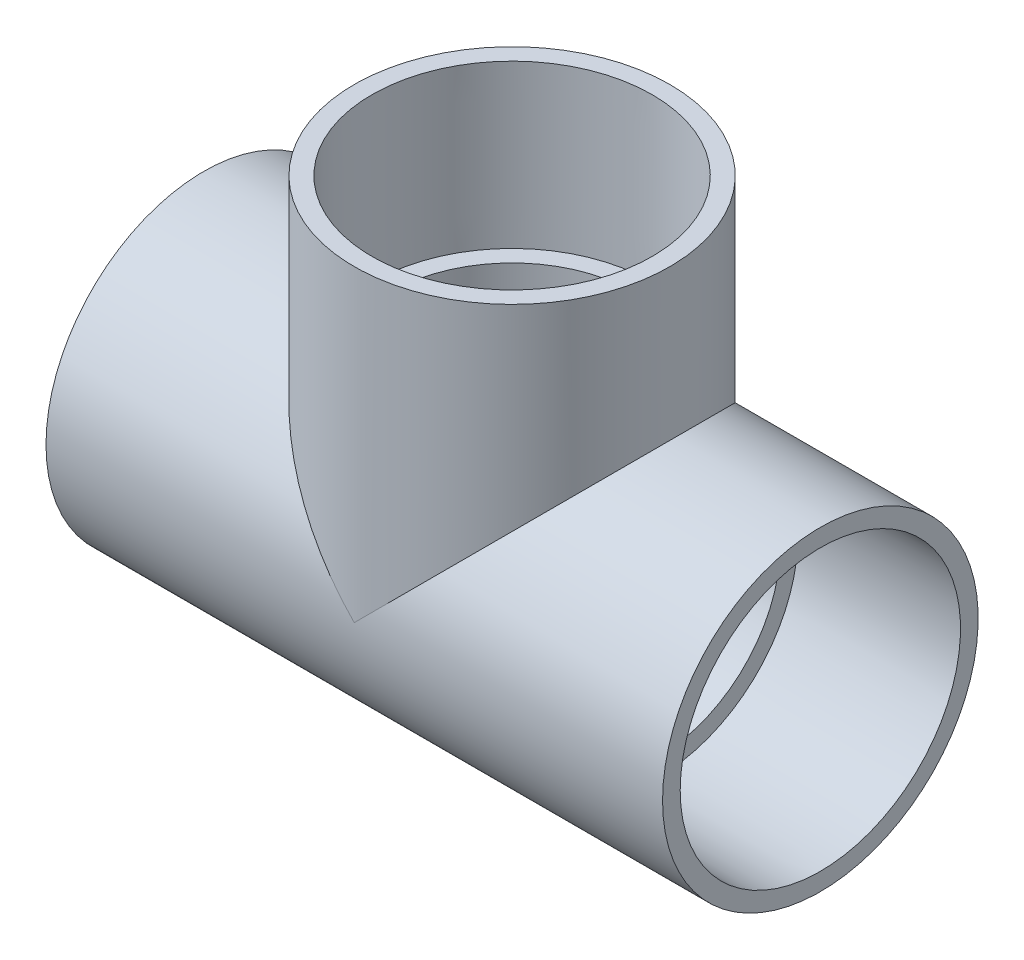
ISO-10303-21;
HEADER;
FILE_DESCRIPTION(('STEP AP214'),'2;1');
FILE_NAME('part.step','',(''),(''),'','','');
FILE_SCHEMA(('AUTOMOTIVE_DESIGN { 1 0 10303 214 1 1 1 1 }'));
ENDSEC;
DATA;
#1=APPLICATION_CONTEXT('core data for automotive mechanical design processes');
#2=APPLICATION_PROTOCOL_DEFINITION('international standard','automotive_design',2000,#1);
#3=PRODUCT_CONTEXT('',#1,'mechanical');
#4=PRODUCT('Part','Part','',(#3));
#5=PRODUCT_RELATED_PRODUCT_CATEGORY('part','',(#4));
#6=PRODUCT_DEFINITION_FORMATION('','',#4);
#7=PRODUCT_DEFINITION_CONTEXT('part definition',#1,'design');
#8=PRODUCT_DEFINITION('design','',#6,#7);
#9=PRODUCT_DEFINITION_SHAPE('','',#8);
#10=(LENGTH_UNIT() NAMED_UNIT(*) SI_UNIT(.MILLI.,.METRE.));
#11=(NAMED_UNIT(*) PLANE_ANGLE_UNIT() SI_UNIT($,.RADIAN.));
#12=(NAMED_UNIT(*) SI_UNIT($,.STERADIAN.) SOLID_ANGLE_UNIT());
#13=UNCERTAINTY_MEASURE_WITH_UNIT(LENGTH_MEASURE(1.E-05),#10,'distance_accuracy_value','');
#14=(GEOMETRIC_REPRESENTATION_CONTEXT(3) GLOBAL_UNCERTAINTY_ASSIGNED_CONTEXT((#13)) GLOBAL_UNIT_ASSIGNED_CONTEXT((#10,
#11,#12)) REPRESENTATION_CONTEXT('',''));
#15=CARTESIAN_POINT('',(0.,0.,0.));
#16=DIRECTION('',(0.,0.,1.));
#17=DIRECTION('',(1.,0.,0.));
#18=AXIS2_PLACEMENT_3D('',#15,#16,#17);
#19=CARTESIAN_POINT('',(-66.675,0.,0.));
#20=DIRECTION('',(-1.,0.,0.));
#21=DIRECTION('',(0.,0.,1.));
#22=AXIS2_PLACEMENT_3D('',#19,#20,#21);
#23=CYLINDRICAL_SURFACE('',#22,34.13125);
#24=CARTESIAN_POINT('',(-66.675,0.,0.));
#25=DIRECTION('',(-1.,0.,0.));
#26=DIRECTION('',(0.,0.,1.));
#27=AXIS2_PLACEMENT_3D('',#24,#25,#26);
#28=CIRCLE('',#27,34.13125);
#29=CARTESIAN_POINT('',(-66.675,0.,34.13125));
#30=VERTEX_POINT('',#29);
#31=EDGE_CURVE('E100',#30,#30,#28,.T.);
#32=ORIENTED_EDGE('',*,*,#31,.F.);
#33=EDGE_LOOP('',(#32));
#34=FACE_BOUND('',#33,.T.);
#35=CARTESIAN_POINT('',(66.675,0.,0.));
#36=DIRECTION('',(-1.,0.,0.));
#37=DIRECTION('',(0.,0.,1.));
#38=AXIS2_PLACEMENT_3D('',#35,#36,#37);
#39=CIRCLE('',#38,34.13125);
#40=CARTESIAN_POINT('',(66.675,0.,34.13125));
#41=VERTEX_POINT('',#40);
#42=EDGE_CURVE('E78',#41,#41,#39,.T.);
#43=ORIENTED_EDGE('',*,*,#42,.T.);
#44=EDGE_LOOP('',(#43));
#45=FACE_BOUND('',#44,.T.);
#46=CARTESIAN_POINT('',(0.,0.,0.));
#47=DIRECTION('',(-0.707106781186547,-0.707106781186547,0.));
#48=DIRECTION('',(-0.707106781186547,0.707106781186547,0.));
#49=AXIS2_PLACEMENT_3D('',#46,#47,#48);
#50=ELLIPSE('',#49,48.2688766507467,34.13125);
#51=CARTESIAN_POINT('',(0.,0.,-34.13125));
#52=VERTEX_POINT('',#51);
#53=CARTESIAN_POINT('',(0.,0.,34.13125));
#54=VERTEX_POINT('',#53);
#55=EDGE_CURVE('E55',#52,#54,#50,.F.);
#56=ORIENTED_EDGE('',*,*,#55,.F.);
#57=CARTESIAN_POINT('',(0.,0.,0.));
#58=DIRECTION('',(0.707106781186547,-0.707106781186547,0.));
#59=DIRECTION('',(-0.707106781186547,-0.707106781186547,0.));
#60=AXIS2_PLACEMENT_3D('',#57,#58,#59);
#61=ELLIPSE('',#60,48.2688766507467,34.13125);
#62=EDGE_CURVE('E91',#52,#54,#61,.T.);
#63=ORIENTED_EDGE('',*,*,#62,.T.);
#64=EDGE_LOOP('',(#56,#63));
#65=FACE_BOUND('',#64,.T.);
#66=ADVANCED_FACE('F36',(#34,#45,#65),#23,.T.);
#67=CARTESIAN_POINT('',(-66.675,-34.13125,0.));
#68=DIRECTION('',(-1.,0.,0.));
#69=DIRECTION('',(0.,0.,1.));
#70=AXIS2_PLACEMENT_3D('',#67,#68,#69);
#71=PLANE('',#70);
#72=ORIENTED_EDGE('',*,*,#31,.T.);
#73=EDGE_LOOP('',(#72));
#74=FACE_BOUND('',#73,.T.);
#75=CARTESIAN_POINT('',(-66.675,0.,0.));
#76=DIRECTION('',(-1.,0.,0.));
#77=DIRECTION('',(0.,0.,1.));
#78=AXIS2_PLACEMENT_3D('',#75,#76,#77);
#79=CIRCLE('',#78,30.3149);
#80=CARTESIAN_POINT('',(-66.675,0.,30.3149));
#81=VERTEX_POINT('',#80);
#82=EDGE_CURVE('E108',#81,#81,#79,.T.);
#83=ORIENTED_EDGE('',*,*,#82,.F.);
#84=EDGE_LOOP('',(#83));
#85=FACE_BOUND('',#84,.T.);
#86=ADVANCED_FACE('F38',(#74,#85),#71,.T.);
#87=CARTESIAN_POINT('',(-31.75,0.,0.));
#88=DIRECTION('',(-1.,0.,0.));
#89=DIRECTION('',(0.,0.,1.));
#90=AXIS2_PLACEMENT_3D('',#87,#88,#89);
#91=CONICAL_SURFACE('',#90,30.0863,0.00654536107227494);
#92=ORIENTED_EDGE('',*,*,#82,.T.);
#93=EDGE_LOOP('',(#92));
#94=FACE_BOUND('',#93,.T.);
#95=CARTESIAN_POINT('',(-31.75,0.,0.));
#96=DIRECTION('',(-1.,0.,0.));
#97=DIRECTION('',(0.,0.,1.));
#98=AXIS2_PLACEMENT_3D('',#95,#96,#97);
#99=CIRCLE('',#98,30.0863);
#100=CARTESIAN_POINT('',(-31.75,0.,30.0863));
#101=VERTEX_POINT('',#100);
#102=EDGE_CURVE('E105',#101,#101,#99,.T.);
#103=ORIENTED_EDGE('',*,*,#102,.F.);
#104=EDGE_LOOP('',(#103));
#105=FACE_BOUND('',#104,.T.);
#106=ADVANCED_FACE('F142',(#94,#105),#91,.F.);
#107=CARTESIAN_POINT('',(126.618899054498,31.75,-12.5251637339597));
#108=DIRECTION('',(0.,-1.,0.));
#109=DIRECTION('',(0.,0.,-1.));
#110=AXIS2_PLACEMENT_3D('',#107,#108,#109);
#111=PLANE('',#110);
#112=CARTESIAN_POINT('',(0.,31.75,0.));
#113=DIRECTION('',(0.,1.,0.));
#114=DIRECTION('',(0.,0.,1.));
#115=AXIS2_PLACEMENT_3D('',#112,#113,#114);
#116=CIRCLE('',#115,26.2509);
#117=CARTESIAN_POINT('',(0.,31.75,26.2509));
#118=VERTEX_POINT('',#117);
#119=EDGE_CURVE('E76',#118,#118,#116,.T.);
#120=ORIENTED_EDGE('',*,*,#119,.F.);
#121=EDGE_LOOP('',(#120));
#122=FACE_BOUND('',#121,.T.);
#123=CARTESIAN_POINT('',(0.,31.75,0.));
#124=DIRECTION('',(0.,-1.,0.));
#125=DIRECTION('',(0.,0.,-1.));
#126=AXIS2_PLACEMENT_3D('',#123,#124,#125);
#127=CIRCLE('',#126,30.0863);
#128=CARTESIAN_POINT('',(0.,31.75,-30.0863));
#129=VERTEX_POINT('',#128);
#130=EDGE_CURVE('E62',#129,#129,#127,.F.);
#131=ORIENTED_EDGE('',*,*,#130,.T.);
#132=EDGE_LOOP('',(#131));
#133=FACE_BOUND('',#132,.T.);
#134=ADVANCED_FACE('F114',(#122,#133),#111,.F.);
#135=CARTESIAN_POINT('',(-31.75,0.,0.));
#136=DIRECTION('',(1.,0.,0.));
#137=DIRECTION('',(0.,0.,-1.));
#138=AXIS2_PLACEMENT_3D('',#135,#136,#137);
#139=PLANE('',#138);
#140=CARTESIAN_POINT('',(-31.75,0.,0.));
#141=DIRECTION('',(-1.,0.,0.));
#142=DIRECTION('',(0.,0.,1.));
#143=AXIS2_PLACEMENT_3D('',#140,#141,#142);
#144=CIRCLE('',#143,26.2509);
#145=CARTESIAN_POINT('',(-31.75,0.,26.2509));
#146=VERTEX_POINT('',#145);
#147=EDGE_CURVE('E74',#146,#146,#144,.T.);
#148=ORIENTED_EDGE('',*,*,#147,.F.);
#149=EDGE_LOOP('',(#148));
#150=FACE_BOUND('',#149,.T.);
#151=ORIENTED_EDGE('',*,*,#102,.T.);
#152=EDGE_LOOP('',(#151));
#153=FACE_BOUND('',#152,.T.);
#154=ADVANCED_FACE('F127',(#150,#153),#139,.F.);
#155=CARTESIAN_POINT('',(34.13125,66.675,0.));
#156=DIRECTION('',(0.,1.,0.));
#157=DIRECTION('',(0.,0.,1.));
#158=AXIS2_PLACEMENT_3D('',#155,#156,#157);
#159=PLANE('',#158);
#160=CARTESIAN_POINT('',(0.,66.675,0.));
#161=DIRECTION('',(0.,-1.,0.));
#162=DIRECTION('',(0.,0.,-1.));
#163=AXIS2_PLACEMENT_3D('',#160,#161,#162);
#164=CIRCLE('',#163,30.3149);
#165=CARTESIAN_POINT('',(0.,66.675,-30.3149));
#166=VERTEX_POINT('',#165);
#167=EDGE_CURVE('E93',#166,#166,#164,.T.);
#168=ORIENTED_EDGE('',*,*,#167,.T.);
#169=EDGE_LOOP('',(#168));
#170=FACE_BOUND('',#169,.T.);
#171=CARTESIAN_POINT('',(0.,66.675,0.));
#172=DIRECTION('',(0.,-1.,0.));
#173=DIRECTION('',(0.,0.,-1.));
#174=AXIS2_PLACEMENT_3D('',#171,#172,#173);
#175=CIRCLE('',#174,34.13125);
#176=CARTESIAN_POINT('',(0.,66.675,-34.13125));
#177=VERTEX_POINT('',#176);
#178=EDGE_CURVE('E96',#177,#177,#175,.T.);
#179=ORIENTED_EDGE('',*,*,#178,.F.);
#180=EDGE_LOOP('',(#179));
#181=FACE_BOUND('',#180,.T.);
#182=ADVANCED_FACE('F124',(#170,#181),#159,.T.);
#183=CARTESIAN_POINT('',(0.,0.,0.));
#184=DIRECTION('',(0.,-1.,0.));
#185=DIRECTION('',(0.,0.,-1.));
#186=AXIS2_PLACEMENT_3D('',#183,#184,#185);
#187=CYLINDRICAL_SURFACE('',#186,34.13125);
#188=ORIENTED_EDGE('',*,*,#62,.F.);
#189=ORIENTED_EDGE('',*,*,#55,.T.);
#190=EDGE_LOOP('',(#188,#189));
#191=FACE_BOUND('',#190,.T.);
#192=ORIENTED_EDGE('',*,*,#178,.T.);
#193=EDGE_LOOP('',(#192));
#194=FACE_BOUND('',#193,.T.);
#195=ADVANCED_FACE('F120',(#191,#194),#187,.T.);
#196=CARTESIAN_POINT('',(0.,66.675,0.));
#197=DIRECTION('',(0.,1.,0.));
#198=DIRECTION('',(0.,0.,1.));
#199=AXIS2_PLACEMENT_3D('',#196,#197,#198);
#200=CONICAL_SURFACE('',#199,30.3149,0.00654536107227494);
#201=ORIENTED_EDGE('',*,*,#130,.F.);
#202=EDGE_LOOP('',(#201));
#203=FACE_BOUND('',#202,.T.);
#204=ORIENTED_EDGE('',*,*,#167,.F.);
#205=EDGE_LOOP('',(#204));
#206=FACE_BOUND('',#205,.T.);
#207=ADVANCED_FACE('F116',(#203,#206),#200,.F.);
#208=CARTESIAN_POINT('',(66.675,-34.13125,0.));
#209=DIRECTION('',(1.,0.,0.));
#210=DIRECTION('',(0.,0.,1.));
#211=AXIS2_PLACEMENT_3D('',#208,#209,#210);
#212=PLANE('',#211);
#213=ORIENTED_EDGE('',*,*,#42,.F.);
#214=EDGE_LOOP('',(#213));
#215=FACE_BOUND('',#214,.T.);
#216=CARTESIAN_POINT('',(66.675,0.,0.));
#217=DIRECTION('',(-1.,0.,0.));
#218=DIRECTION('',(0.,0.,1.));
#219=AXIS2_PLACEMENT_3D('',#216,#217,#218);
#220=CIRCLE('',#219,30.3149);
#221=CARTESIAN_POINT('',(66.675,0.,30.3149));
#222=VERTEX_POINT('',#221);
#223=EDGE_CURVE('E88',#222,#222,#220,.T.);
#224=ORIENTED_EDGE('',*,*,#223,.T.);
#225=EDGE_LOOP('',(#224));
#226=FACE_BOUND('',#225,.T.);
#227=ADVANCED_FACE('F119',(#215,#226),#212,.T.);
#228=CARTESIAN_POINT('',(31.75,0.,0.));
#229=DIRECTION('',(1.,0.,0.));
#230=DIRECTION('',(0.,0.,1.));
#231=AXIS2_PLACEMENT_3D('',#228,#229,#230);
#232=CONICAL_SURFACE('',#231,30.0863,0.00654536107227494);
#233=ORIENTED_EDGE('',*,*,#223,.F.);
#234=EDGE_LOOP('',(#233));
#235=FACE_BOUND('',#234,.T.);
#236=CARTESIAN_POINT('',(31.75,0.,0.));
#237=DIRECTION('',(-1.,0.,0.));
#238=DIRECTION('',(0.,0.,1.));
#239=AXIS2_PLACEMENT_3D('',#236,#237,#238);
#240=CIRCLE('',#239,30.0863);
#241=CARTESIAN_POINT('',(31.75,0.,30.0863));
#242=VERTEX_POINT('',#241);
#243=EDGE_CURVE('E85',#242,#242,#240,.T.);
#244=ORIENTED_EDGE('',*,*,#243,.T.);
#245=EDGE_LOOP('',(#244));
#246=FACE_BOUND('',#245,.T.);
#247=ADVANCED_FACE('F163',(#235,#246),#232,.F.);
#248=CARTESIAN_POINT('',(31.75,-34.13125,0.));
#249=DIRECTION('',(-1.,0.,0.));
#250=DIRECTION('',(0.,0.,-1.));
#251=AXIS2_PLACEMENT_3D('',#248,#249,#250);
#252=PLANE('',#251);
#253=CARTESIAN_POINT('',(31.75,0.,0.));
#254=DIRECTION('',(-1.,0.,0.));
#255=DIRECTION('',(0.,0.,1.));
#256=AXIS2_PLACEMENT_3D('',#253,#254,#255);
#257=CIRCLE('',#256,26.2509);
#258=CARTESIAN_POINT('',(31.75,0.,26.2509));
#259=VERTEX_POINT('',#258);
#260=EDGE_CURVE('E71',#259,#259,#257,.F.);
#261=ORIENTED_EDGE('',*,*,#260,.F.);
#262=EDGE_LOOP('',(#261));
#263=FACE_BOUND('',#262,.T.);
#264=ORIENTED_EDGE('',*,*,#243,.F.);
#265=EDGE_LOOP('',(#264));
#266=FACE_BOUND('',#265,.T.);
#267=ADVANCED_FACE('F66',(#263,#266),#252,.F.);
#268=CARTESIAN_POINT('',(105.998757609,0.,0.));
#269=DIRECTION('',(-1.,0.,0.));
#270=DIRECTION('',(0.,0.,1.));
#271=AXIS2_PLACEMENT_3D('',#268,#269,#270);
#272=CYLINDRICAL_SURFACE('',#271,26.2509);
#273=CARTESIAN_POINT('',(0.,0.,0.));
#274=DIRECTION('',(-0.707106781186547,-0.707106781186547,0.));
#275=DIRECTION('',(-0.707106781186547,0.707106781186547,0.));
#276=AXIS2_PLACEMENT_3D('',#273,#274,#275);
#277=ELLIPSE('',#276,37.1243788044999,26.2509);
#278=CARTESIAN_POINT('',(0.,0.,-26.2509));
#279=VERTEX_POINT('',#278);
#280=CARTESIAN_POINT('',(0.,0.,26.2509));
#281=VERTEX_POINT('',#280);
#282=EDGE_CURVE('E44',#279,#281,#277,.F.);
#283=ORIENTED_EDGE('',*,*,#282,.T.);
#284=CARTESIAN_POINT('',(0.,0.,0.));
#285=DIRECTION('',(-0.707106781186547,0.707106781186547,0.));
#286=DIRECTION('',(-0.707106781186547,-0.707106781186547,0.));
#287=AXIS2_PLACEMENT_3D('',#284,#285,#286);
#288=ELLIPSE('',#287,37.1243788044999,26.2509);
#289=EDGE_CURVE('E11',#281,#279,#288,.T.);
#290=ORIENTED_EDGE('',*,*,#289,.T.);
#291=EDGE_LOOP('',(#283,#290));
#292=FACE_BOUND('',#291,.T.);
#293=ORIENTED_EDGE('',*,*,#260,.T.);
#294=EDGE_LOOP('',(#293));
#295=FACE_BOUND('',#294,.T.);
#296=ORIENTED_EDGE('',*,*,#147,.T.);
#297=EDGE_LOOP('',(#296));
#298=FACE_BOUND('',#297,.T.);
#299=ADVANCED_FACE('F63',(#292,#295,#298),#272,.F.);
#300=CARTESIAN_POINT('',(0.,0.,0.));
#301=DIRECTION('',(0.,1.,0.));
#302=DIRECTION('',(0.,0.,1.));
#303=AXIS2_PLACEMENT_3D('',#300,#301,#302);
#304=CYLINDRICAL_SURFACE('',#303,26.2509);
#305=ORIENTED_EDGE('',*,*,#119,.T.);
#306=EDGE_LOOP('',(#305));
#307=FACE_BOUND('',#306,.T.);
#308=ORIENTED_EDGE('',*,*,#282,.F.);
#309=ORIENTED_EDGE('',*,*,#289,.F.);
#310=EDGE_LOOP('',(#308,#309));
#311=FACE_BOUND('',#310,.T.);
#312=ADVANCED_FACE('F60',(#307,#311),#304,.F.);
#313=CLOSED_SHELL('',(#66,#86,#106,#134,#154,#182,#195,#207,#227,#247,#267,#299,#312));
#314=MANIFOLD_SOLID_BREP('B2',#313);
#315=ADVANCED_BREP_SHAPE_REPRESENTATION('',(#18,#314),#14);
#316=SHAPE_DEFINITION_REPRESENTATION(#9,#315);
ENDSEC;
END-ISO-10303-21;
